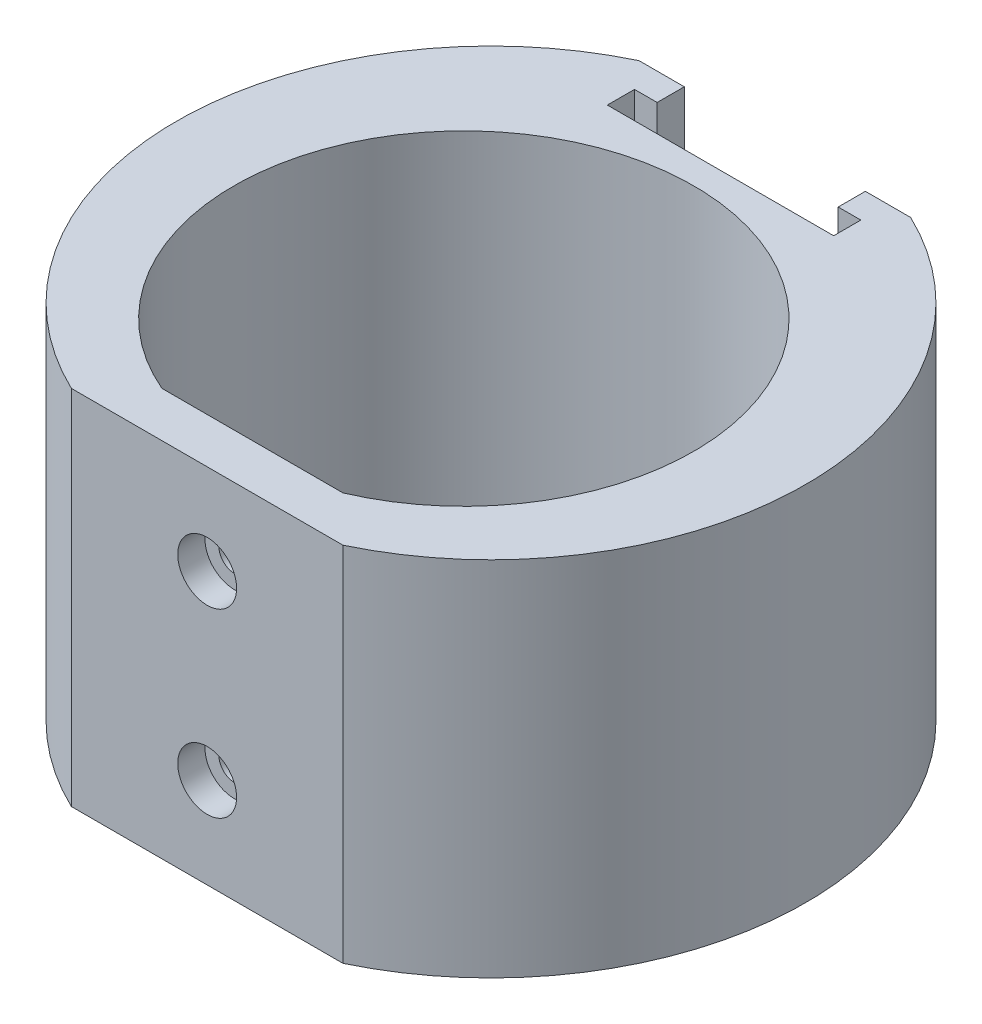
ISO-10303-21;
HEADER;
FILE_DESCRIPTION(('STEP AP214'),'2;1');
FILE_NAME('part.step','',(''),(''),'','','');
FILE_SCHEMA(('AUTOMOTIVE_DESIGN { 1 0 10303 214 1 1 1 1 }'));
ENDSEC;
DATA;
#1=APPLICATION_CONTEXT('core data for automotive mechanical design processes');
#2=APPLICATION_PROTOCOL_DEFINITION('international standard','automotive_design',2000,#1);
#3=PRODUCT_CONTEXT('',#1,'mechanical');
#4=PRODUCT('Part','Part','',(#3));
#5=PRODUCT_RELATED_PRODUCT_CATEGORY('part','',(#4));
#6=PRODUCT_DEFINITION_FORMATION('','',#4);
#7=PRODUCT_DEFINITION_CONTEXT('part definition',#1,'design');
#8=PRODUCT_DEFINITION('design','',#6,#7);
#9=PRODUCT_DEFINITION_SHAPE('','',#8);
#10=(LENGTH_UNIT() NAMED_UNIT(*) SI_UNIT(.MILLI.,.METRE.));
#11=(NAMED_UNIT(*) PLANE_ANGLE_UNIT() SI_UNIT($,.RADIAN.));
#12=(NAMED_UNIT(*) SI_UNIT($,.STERADIAN.) SOLID_ANGLE_UNIT());
#13=UNCERTAINTY_MEASURE_WITH_UNIT(LENGTH_MEASURE(1.E-05),#10,'distance_accuracy_value','');
#14=(GEOMETRIC_REPRESENTATION_CONTEXT(3) GLOBAL_UNCERTAINTY_ASSIGNED_CONTEXT((#13)) GLOBAL_UNIT_ASSIGNED_CONTEXT((#10,
#11,#12)) REPRESENTATION_CONTEXT('',''));
#15=CARTESIAN_POINT('',(0.,0.,0.));
#16=DIRECTION('',(0.,0.,1.));
#17=DIRECTION('',(1.,0.,0.));
#18=AXIS2_PLACEMENT_3D('',#15,#16,#17);
#19=CARTESIAN_POINT('',(0.,20.,-3.));
#20=DIRECTION('',(0.,1.,0.));
#21=DIRECTION('',(0.,0.,1.));
#22=AXIS2_PLACEMENT_3D('',#19,#20,#21);
#23=PLANE('',#22);
#24=DIRECTION('',(0.,0.,-1.));
#25=VECTOR('',#24,1.);
#26=CARTESIAN_POINT('',(10.,20.,-31.3486616318795));
#27=LINE('',#26,#25);
#28=CARTESIAN_POINT('',(10.,20.,-31.3486616318795));
#29=VERTEX_POINT('',#28);
#30=CARTESIAN_POINT('',(10.,20.,-34.3486616318795));
#31=VERTEX_POINT('',#30);
#32=EDGE_CURVE('E269',#29,#31,#27,.T.);
#33=ORIENTED_EDGE('',*,*,#32,.F.);
#34=DIRECTION('',(-1.,0.,0.));
#35=VECTOR('',#34,1.);
#36=CARTESIAN_POINT('',(12.5,20.,-31.3486616318795));
#37=LINE('',#36,#35);
#38=CARTESIAN_POINT('',(12.5,20.,-31.3486616318795));
#39=VERTEX_POINT('',#38);
#40=EDGE_CURVE('E274',#39,#29,#37,.T.);
#41=ORIENTED_EDGE('',*,*,#40,.F.);
#42=DIRECTION('',(0.,0.,-1.));
#43=VECTOR('',#42,1.);
#44=CARTESIAN_POINT('',(12.5,20.,-28.3486616318795));
#45=LINE('',#44,#43);
#46=CARTESIAN_POINT('',(12.5,20.,-28.3486616318795));
#47=VERTEX_POINT('',#46);
#48=EDGE_CURVE('E289',#47,#39,#45,.T.);
#49=ORIENTED_EDGE('',*,*,#48,.F.);
#50=DIRECTION('',(1.,0.,0.));
#51=VECTOR('',#50,1.);
#52=CARTESIAN_POINT('',(-12.5,20.,-28.3486616318795));
#53=LINE('',#52,#51);
#54=CARTESIAN_POINT('',(-12.5,20.,-28.3486616318795));
#55=VERTEX_POINT('',#54);
#56=EDGE_CURVE('E286',#55,#47,#53,.T.);
#57=ORIENTED_EDGE('',*,*,#56,.F.);
#58=DIRECTION('',(0.,0.,1.));
#59=VECTOR('',#58,1.);
#60=CARTESIAN_POINT('',(-12.5,20.,-31.3486616318795));
#61=LINE('',#60,#59);
#62=CARTESIAN_POINT('',(-12.5,20.,-31.3486616318795));
#63=VERTEX_POINT('',#62);
#64=EDGE_CURVE('E283',#63,#55,#61,.T.);
#65=ORIENTED_EDGE('',*,*,#64,.F.);
#66=DIRECTION('',(-1.,0.,0.));
#67=VECTOR('',#66,1.);
#68=CARTESIAN_POINT('',(-10.,20.,-31.3486616318795));
#69=LINE('',#68,#67);
#70=CARTESIAN_POINT('',(-10.,20.,-31.3486616318795));
#71=VERTEX_POINT('',#70);
#72=EDGE_CURVE('E185',#71,#63,#69,.T.);
#73=ORIENTED_EDGE('',*,*,#72,.F.);
#74=DIRECTION('',(0.,0.,1.));
#75=VECTOR('',#74,1.);
#76=CARTESIAN_POINT('',(-10.,20.,-34.3486616318795));
#77=LINE('',#76,#75);
#78=CARTESIAN_POINT('',(-10.,20.,-34.3486616318795));
#79=VERTEX_POINT('',#78);
#80=EDGE_CURVE('E168',#79,#71,#77,.T.);
#81=ORIENTED_EDGE('',*,*,#80,.F.);
#82=DIRECTION('',(-1.,0.,0.));
#83=VECTOR('',#82,1.);
#84=CARTESIAN_POINT('',(-15.,20.,-34.3486616318795));
#85=LINE('',#84,#83);
#86=CARTESIAN_POINT('',(-15.,20.,-34.3486616318795));
#87=VERTEX_POINT('',#86);
#88=EDGE_CURVE('E181',#79,#87,#85,.T.);
#89=ORIENTED_EDGE('',*,*,#88,.T.);
#90=CARTESIAN_POINT('',(0.,20.,-3.));
#91=DIRECTION('',(0.,1.,0.));
#92=DIRECTION('',(0.,0.,1.));
#93=AXIS2_PLACEMENT_3D('',#90,#91,#92);
#94=CIRCLE('',#93,34.7525335207388);
#95=CARTESIAN_POINT('',(-15.,20.,28.3486616318795));
#96=VERTEX_POINT('',#95);
#97=EDGE_CURVE('E197',#87,#96,#94,.T.);
#98=ORIENTED_EDGE('',*,*,#97,.T.);
#99=DIRECTION('',(1.,0.,0.));
#100=VECTOR('',#99,1.);
#101=CARTESIAN_POINT('',(-15.,20.,28.3486616318795));
#102=LINE('',#101,#100);
#103=CARTESIAN_POINT('',(15.,20.,28.3486616318795));
#104=VERTEX_POINT('',#103);
#105=EDGE_CURVE('E204',#96,#104,#102,.T.);
#106=ORIENTED_EDGE('',*,*,#105,.T.);
#107=CARTESIAN_POINT('',(0.,20.,-3.));
#108=DIRECTION('',(0.,1.,0.));
#109=DIRECTION('',(0.,0.,1.));
#110=AXIS2_PLACEMENT_3D('',#107,#108,#109);
#111=CIRCLE('',#110,34.7525335207388);
#112=CARTESIAN_POINT('',(15.,20.,-34.3486616318795));
#113=VERTEX_POINT('',#112);
#114=EDGE_CURVE('E194',#104,#113,#111,.T.);
#115=ORIENTED_EDGE('',*,*,#114,.T.);
#116=EDGE_CURVE('E193',#113,#31,#85,.T.);
#117=ORIENTED_EDGE('',*,*,#116,.T.);
#118=EDGE_LOOP('',(#33,#41,#49,#57,#65,#73,#81,#89,#98,#106,#115,#117));
#119=FACE_BOUND('',#118,.T.);
#120=DIRECTION('',(1.,0.,0.));
#121=VECTOR('',#120,1.);
#122=CARTESIAN_POINT('',(-10.,20.,23.3486616318795));
#123=LINE('',#122,#121);
#124=CARTESIAN_POINT('',(-10.,20.,23.3486616318795));
#125=VERTEX_POINT('',#124);
#126=CARTESIAN_POINT('',(10.,20.,23.3486616318795));
#127=VERTEX_POINT('',#126);
#128=EDGE_CURVE('E309',#125,#127,#123,.T.);
#129=ORIENTED_EDGE('',*,*,#128,.F.);
#130=CARTESIAN_POINT('',(0.,20.,0.));
#131=DIRECTION('',(0.,1.,0.));
#132=DIRECTION('',(0.,0.,1.));
#133=AXIS2_PLACEMENT_3D('',#130,#131,#132);
#134=CIRCLE('',#133,25.4);
#135=EDGE_CURVE('E306',#127,#125,#134,.T.);
#136=ORIENTED_EDGE('',*,*,#135,.F.);
#137=EDGE_LOOP('',(#129,#136));
#138=FACE_BOUND('',#137,.T.);
#139=ADVANCED_FACE('F39',(#119,#138),#23,.T.);
#140=CARTESIAN_POINT('',(0.,-20.,-3.));
#141=DIRECTION('',(0.,1.,0.));
#142=DIRECTION('',(0.,0.,1.));
#143=AXIS2_PLACEMENT_3D('',#140,#141,#142);
#144=PLANE('',#143);
#145=CARTESIAN_POINT('',(0.,-20.,-3.));
#146=DIRECTION('',(0.,1.,0.));
#147=DIRECTION('',(0.,0.,1.));
#148=AXIS2_PLACEMENT_3D('',#145,#146,#147);
#149=CIRCLE('',#148,34.7525335207388);
#150=CARTESIAN_POINT('',(15.,-20.,28.3486616318795));
#151=VERTEX_POINT('',#150);
#152=CARTESIAN_POINT('',(15.,-20.,-34.3486616318795));
#153=VERTEX_POINT('',#152);
#154=EDGE_CURVE('E207',#151,#153,#149,.T.);
#155=ORIENTED_EDGE('',*,*,#154,.F.);
#156=DIRECTION('',(1.,0.,0.));
#157=VECTOR('',#156,1.);
#158=CARTESIAN_POINT('',(-15.,-20.,28.3486616318795));
#159=LINE('',#158,#157);
#160=CARTESIAN_POINT('',(-15.,-20.,28.3486616318795));
#161=VERTEX_POINT('',#160);
#162=EDGE_CURVE('E199',#161,#151,#159,.T.);
#163=ORIENTED_EDGE('',*,*,#162,.F.);
#164=CARTESIAN_POINT('',(0.,-20.,-3.));
#165=DIRECTION('',(0.,1.,0.));
#166=DIRECTION('',(0.,0.,1.));
#167=AXIS2_PLACEMENT_3D('',#164,#165,#166);
#168=CIRCLE('',#167,34.7525335207388);
#169=CARTESIAN_POINT('',(-15.,-20.,-34.3486616318795));
#170=VERTEX_POINT('',#169);
#171=EDGE_CURVE('E213',#170,#161,#168,.T.);
#172=ORIENTED_EDGE('',*,*,#171,.F.);
#173=DIRECTION('',(-1.,0.,0.));
#174=VECTOR('',#173,1.);
#175=CARTESIAN_POINT('',(-15.,-20.,-34.3486616318795));
#176=LINE('',#175,#174);
#177=EDGE_CURVE('E210',#153,#170,#176,.T.);
#178=ORIENTED_EDGE('',*,*,#177,.F.);
#179=EDGE_LOOP('',(#155,#163,#172,#178));
#180=FACE_BOUND('',#179,.T.);
#181=CARTESIAN_POINT('',(0.,-20.,0.));
#182=DIRECTION('',(0.,1.,0.));
#183=DIRECTION('',(0.,0.,1.));
#184=AXIS2_PLACEMENT_3D('',#181,#182,#183);
#185=CIRCLE('',#184,25.4);
#186=CARTESIAN_POINT('',(10.,-20.,23.3486616318795));
#187=VERTEX_POINT('',#186);
#188=CARTESIAN_POINT('',(-10.,-20.,23.3486616318795));
#189=VERTEX_POINT('',#188);
#190=EDGE_CURVE('E296',#187,#189,#185,.T.);
#191=ORIENTED_EDGE('',*,*,#190,.T.);
#192=DIRECTION('',(1.,0.,0.));
#193=VECTOR('',#192,1.);
#194=CARTESIAN_POINT('',(-10.,-20.,23.3486616318795));
#195=LINE('',#194,#193);
#196=EDGE_CURVE('E310',#189,#187,#195,.T.);
#197=ORIENTED_EDGE('',*,*,#196,.T.);
#198=EDGE_LOOP('',(#191,#197));
#199=FACE_BOUND('',#198,.T.);
#200=ADVANCED_FACE('F326',(#180,#199),#144,.F.);
#201=CARTESIAN_POINT('',(0.,20.,-3.));
#202=DIRECTION('',(0.,-1.,0.));
#203=DIRECTION('',(0.,0.,-1.));
#204=AXIS2_PLACEMENT_3D('',#201,#202,#203);
#205=CYLINDRICAL_SURFACE('',#204,34.7525335207388);
#206=ORIENTED_EDGE('',*,*,#154,.T.);
#207=DIRECTION('',(0.,-1.,0.));
#208=VECTOR('',#207,1.);
#209=CARTESIAN_POINT('',(15.,20.,-34.3486616318795));
#210=LINE('',#209,#208);
#211=EDGE_CURVE('E222',#113,#153,#210,.T.);
#212=ORIENTED_EDGE('',*,*,#211,.F.);
#213=ORIENTED_EDGE('',*,*,#114,.F.);
#214=DIRECTION('',(0.,-1.,0.));
#215=VECTOR('',#214,1.);
#216=CARTESIAN_POINT('',(15.,20.,28.3486616318795));
#217=LINE('',#216,#215);
#218=EDGE_CURVE('E206',#104,#151,#217,.T.);
#219=ORIENTED_EDGE('',*,*,#218,.T.);
#220=EDGE_LOOP('',(#206,#212,#213,#219));
#221=FACE_BOUND('',#220,.T.);
#222=ADVANCED_FACE('F333',(#221),#205,.T.);
#223=CARTESIAN_POINT('',(-15.,20.,-34.3486616318795));
#224=DIRECTION('',(0.,0.,1.));
#225=DIRECTION('',(1.,0.,0.));
#226=AXIS2_PLACEMENT_3D('',#223,#224,#225);
#227=PLANE('',#226);
#228=DIRECTION('',(-1.,0.,0.));
#229=VECTOR('',#228,1.);
#230=CARTESIAN_POINT('',(-10.,-7.5,-34.3486616318795));
#231=LINE('',#230,#229);
#232=CARTESIAN_POINT('',(8.,-7.5,-34.3486616318795));
#233=VERTEX_POINT('',#232);
#234=CARTESIAN_POINT('',(-8.,-7.5,-34.3486616318795));
#235=VERTEX_POINT('',#234);
#236=EDGE_CURVE('E265',#233,#235,#231,.T.);
#237=ORIENTED_EDGE('',*,*,#236,.F.);
#238=CARTESIAN_POINT('',(8.,-5.5,-34.3486616318795));
#239=DIRECTION('',(0.,0.,1.));
#240=DIRECTION('',(1.,0.,0.));
#241=AXIS2_PLACEMENT_3D('',#238,#239,#240);
#242=CIRCLE('',#241,2.);
#243=CARTESIAN_POINT('',(10.,-5.5,-34.3486616318795));
#244=VERTEX_POINT('',#243);
#245=EDGE_CURVE('E250',#233,#244,#242,.T.);
#246=ORIENTED_EDGE('',*,*,#245,.T.);
#247=DIRECTION('',(0.,1.,0.));
#248=VECTOR('',#247,1.);
#249=CARTESIAN_POINT('',(10.,-7.5,-34.3486616318795));
#250=LINE('',#249,#248);
#251=EDGE_CURVE('E294',#244,#31,#250,.T.);
#252=ORIENTED_EDGE('',*,*,#251,.T.);
#253=ORIENTED_EDGE('',*,*,#116,.F.);
#254=ORIENTED_EDGE('',*,*,#211,.T.);
#255=ORIENTED_EDGE('',*,*,#177,.T.);
#256=DIRECTION('',(0.,-1.,0.));
#257=VECTOR('',#256,1.);
#258=CARTESIAN_POINT('',(-15.,20.,-34.3486616318795));
#259=LINE('',#258,#257);
#260=EDGE_CURVE('E191',#87,#170,#259,.T.);
#261=ORIENTED_EDGE('',*,*,#260,.F.);
#262=ORIENTED_EDGE('',*,*,#88,.F.);
#263=DIRECTION('',(0.,1.,0.));
#264=VECTOR('',#263,1.);
#265=CARTESIAN_POINT('',(-10.,-7.5,-34.3486616318795));
#266=LINE('',#265,#264);
#267=CARTESIAN_POINT('',(-10.,-5.5,-34.3486616318795));
#268=VERTEX_POINT('',#267);
#269=EDGE_CURVE('E164',#268,#79,#266,.T.);
#270=ORIENTED_EDGE('',*,*,#269,.F.);
#271=CARTESIAN_POINT('',(-8.,-5.5,-34.3486616318795));
#272=DIRECTION('',(0.,0.,1.));
#273=DIRECTION('',(1.,0.,0.));
#274=AXIS2_PLACEMENT_3D('',#271,#272,#273);
#275=CIRCLE('',#274,2.);
#276=EDGE_CURVE('E11',#268,#235,#275,.T.);
#277=ORIENTED_EDGE('',*,*,#276,.T.);
#278=EDGE_LOOP('',(#237,#246,#252,#253,#254,#255,#261,#262,#270,#277));
#279=FACE_BOUND('',#278,.T.);
#280=ADVANCED_FACE('F189',(#279),#227,.F.);
#281=CARTESIAN_POINT('',(0.,20.,-3.));
#282=DIRECTION('',(0.,-1.,0.));
#283=DIRECTION('',(0.,0.,-1.));
#284=AXIS2_PLACEMENT_3D('',#281,#282,#283);
#285=CYLINDRICAL_SURFACE('',#284,34.7525335207388);
#286=ORIENTED_EDGE('',*,*,#171,.T.);
#287=DIRECTION('',(0.,-1.,0.));
#288=VECTOR('',#287,1.);
#289=CARTESIAN_POINT('',(-15.,20.,28.3486616318795));
#290=LINE('',#289,#288);
#291=EDGE_CURVE('E218',#96,#161,#290,.T.);
#292=ORIENTED_EDGE('',*,*,#291,.F.);
#293=ORIENTED_EDGE('',*,*,#97,.F.);
#294=ORIENTED_EDGE('',*,*,#260,.T.);
#295=EDGE_LOOP('',(#286,#292,#293,#294));
#296=FACE_BOUND('',#295,.T.);
#297=ADVANCED_FACE('F342',(#296),#285,.T.);
#298=CARTESIAN_POINT('',(-15.,20.,28.3486616318795));
#299=DIRECTION('',(0.,0.,-1.));
#300=DIRECTION('',(-1.,0.,0.));
#301=AXIS2_PLACEMENT_3D('',#298,#299,#300);
#302=PLANE('',#301);
#303=CARTESIAN_POINT('',(0.,10.,28.3486616318795));
#304=DIRECTION('',(0.,0.,1.));
#305=DIRECTION('',(1.,0.,0.));
#306=AXIS2_PLACEMENT_3D('',#303,#304,#305);
#307=CIRCLE('',#306,3.25);
#308=CARTESIAN_POINT('',(3.25,10.,28.3486616318795));
#309=VERTEX_POINT('',#308);
#310=EDGE_CURVE('E439',#309,#309,#307,.T.);
#311=ORIENTED_EDGE('',*,*,#310,.F.);
#312=EDGE_LOOP('',(#311));
#313=FACE_BOUND('',#312,.T.);
#314=CARTESIAN_POINT('',(0.,-10.,28.3486616318795));
#315=DIRECTION('',(0.,0.,1.));
#316=DIRECTION('',(1.,0.,0.));
#317=AXIS2_PLACEMENT_3D('',#314,#315,#316);
#318=CIRCLE('',#317,3.25);
#319=CARTESIAN_POINT('',(3.25,-10.,28.3486616318795));
#320=VERTEX_POINT('',#319);
#321=EDGE_CURVE('E427',#320,#320,#318,.T.);
#322=ORIENTED_EDGE('',*,*,#321,.F.);
#323=EDGE_LOOP('',(#322));
#324=FACE_BOUND('',#323,.T.);
#325=ORIENTED_EDGE('',*,*,#162,.T.);
#326=ORIENTED_EDGE('',*,*,#218,.F.);
#327=ORIENTED_EDGE('',*,*,#105,.F.);
#328=ORIENTED_EDGE('',*,*,#291,.T.);
#329=EDGE_LOOP('',(#325,#326,#327,#328));
#330=FACE_BOUND('',#329,.T.);
#331=ADVANCED_FACE('F339',(#313,#324,#330),#302,.F.);
#332=CARTESIAN_POINT('',(0.,20.,0.));
#333=DIRECTION('',(0.,-1.,0.));
#334=DIRECTION('',(0.,0.,-1.));
#335=AXIS2_PLACEMENT_3D('',#332,#333,#334);
#336=CYLINDRICAL_SURFACE('',#335,25.4);
#337=ORIENTED_EDGE('',*,*,#190,.F.);
#338=DIRECTION('',(0.,-1.,0.));
#339=VECTOR('',#338,1.);
#340=CARTESIAN_POINT('',(10.,20.,23.3486616318795));
#341=LINE('',#340,#339);
#342=EDGE_CURVE('E312',#127,#187,#341,.T.);
#343=ORIENTED_EDGE('',*,*,#342,.F.);
#344=ORIENTED_EDGE('',*,*,#135,.T.);
#345=DIRECTION('',(0.,-1.,0.));
#346=VECTOR('',#345,1.);
#347=CARTESIAN_POINT('',(-10.,20.,23.3486616318795));
#348=LINE('',#347,#346);
#349=EDGE_CURVE('E211',#125,#189,#348,.T.);
#350=ORIENTED_EDGE('',*,*,#349,.T.);
#351=EDGE_LOOP('',(#337,#343,#344,#350));
#352=FACE_BOUND('',#351,.T.);
#353=ADVANCED_FACE('F320',(#352),#336,.F.);
#354=CARTESIAN_POINT('',(-10.,20.,23.3486616318795));
#355=DIRECTION('',(0.,0.,-1.));
#356=DIRECTION('',(-1.,0.,0.));
#357=AXIS2_PLACEMENT_3D('',#354,#355,#356);
#358=PLANE('',#357);
#359=CARTESIAN_POINT('',(0.,10.,23.3486616318795));
#360=DIRECTION('',(0.,0.,-1.));
#361=DIRECTION('',(-1.,0.,0.));
#362=AXIS2_PLACEMENT_3D('',#359,#360,#361);
#363=CIRCLE('',#362,1.7);
#364=CARTESIAN_POINT('',(-1.7,10.,23.3486616318795));
#365=VERTEX_POINT('',#364);
#366=EDGE_CURVE('E417',#365,#365,#363,.T.);
#367=ORIENTED_EDGE('',*,*,#366,.F.);
#368=EDGE_LOOP('',(#367));
#369=FACE_BOUND('',#368,.T.);
#370=CARTESIAN_POINT('',(0.,-10.,23.3486616318795));
#371=DIRECTION('',(0.,0.,-1.));
#372=DIRECTION('',(-1.,0.,0.));
#373=AXIS2_PLACEMENT_3D('',#370,#371,#372);
#374=CIRCLE('',#373,1.7);
#375=CARTESIAN_POINT('',(-1.69999999999999,-10.,23.3486616318795));
#376=VERTEX_POINT('',#375);
#377=EDGE_CURVE('E186',#376,#376,#374,.T.);
#378=ORIENTED_EDGE('',*,*,#377,.F.);
#379=EDGE_LOOP('',(#378));
#380=FACE_BOUND('',#379,.T.);
#381=ORIENTED_EDGE('',*,*,#196,.F.);
#382=ORIENTED_EDGE('',*,*,#349,.F.);
#383=ORIENTED_EDGE('',*,*,#128,.T.);
#384=ORIENTED_EDGE('',*,*,#342,.T.);
#385=EDGE_LOOP('',(#381,#382,#383,#384));
#386=FACE_BOUND('',#385,.T.);
#387=ADVANCED_FACE('F327',(#369,#380,#386),#358,.T.);
#388=CARTESIAN_POINT('',(10.,-7.5,-31.3486616318795));
#389=DIRECTION('',(1.,0.,0.));
#390=DIRECTION('',(0.,0.,-1.));
#391=AXIS2_PLACEMENT_3D('',#388,#389,#390);
#392=PLANE('',#391);
#393=ORIENTED_EDGE('',*,*,#251,.F.);
#394=DIRECTION('',(0.,0.,-1.));
#395=VECTOR('',#394,1.);
#396=CARTESIAN_POINT('',(10.,-5.5,-31.3486616318795));
#397=LINE('',#396,#395);
#398=CARTESIAN_POINT('',(10.,-5.5,-31.3486616318795));
#399=VERTEX_POINT('',#398);
#400=EDGE_CURVE('E237',#244,#399,#397,.F.);
#401=ORIENTED_EDGE('',*,*,#400,.T.);
#402=DIRECTION('',(0.,1.,0.));
#403=VECTOR('',#402,1.);
#404=CARTESIAN_POINT('',(10.,-7.5,-31.3486616318795));
#405=LINE('',#404,#403);
#406=EDGE_CURVE('E297',#399,#29,#405,.T.);
#407=ORIENTED_EDGE('',*,*,#406,.T.);
#408=ORIENTED_EDGE('',*,*,#32,.T.);
#409=EDGE_LOOP('',(#393,#401,#407,#408));
#410=FACE_BOUND('',#409,.T.);
#411=ADVANCED_FACE('F380',(#410),#392,.F.);
#412=CARTESIAN_POINT('',(12.5,-7.5,-31.3486616318795));
#413=DIRECTION('',(0.,0.,-1.));
#414=DIRECTION('',(-1.,0.,0.));
#415=AXIS2_PLACEMENT_3D('',#412,#413,#414);
#416=PLANE('',#415);
#417=DIRECTION('',(-1.,0.,0.));
#418=VECTOR('',#417,1.);
#419=CARTESIAN_POINT('',(12.5,-7.5,-31.3486616318795));
#420=LINE('',#419,#418);
#421=CARTESIAN_POINT('',(10.5,-7.5,-31.3486616318795));
#422=VERTEX_POINT('',#421);
#423=CARTESIAN_POINT('',(8.,-7.5,-31.3486616318795));
#424=VERTEX_POINT('',#423);
#425=EDGE_CURVE('E176',#422,#424,#420,.T.);
#426=ORIENTED_EDGE('',*,*,#425,.F.);
#427=CARTESIAN_POINT('',(10.5,-5.5,-31.3486616318795));
#428=DIRECTION('',(0.,0.,-1.));
#429=DIRECTION('',(-1.,0.,0.));
#430=AXIS2_PLACEMENT_3D('',#427,#428,#429);
#431=CIRCLE('',#430,2.);
#432=CARTESIAN_POINT('',(12.5,-5.5,-31.3486616318795));
#433=VERTEX_POINT('',#432);
#434=EDGE_CURVE('E54',#422,#433,#431,.F.);
#435=ORIENTED_EDGE('',*,*,#434,.T.);
#436=DIRECTION('',(0.,1.,0.));
#437=VECTOR('',#436,1.);
#438=CARTESIAN_POINT('',(12.5,-7.5,-31.3486616318795));
#439=LINE('',#438,#437);
#440=EDGE_CURVE('E299',#433,#39,#439,.T.);
#441=ORIENTED_EDGE('',*,*,#440,.T.);
#442=ORIENTED_EDGE('',*,*,#40,.T.);
#443=ORIENTED_EDGE('',*,*,#406,.F.);
#444=CARTESIAN_POINT('',(8.,-5.5,-31.3486616318795));
#445=DIRECTION('',(0.,0.,-1.));
#446=DIRECTION('',(-1.,0.,0.));
#447=AXIS2_PLACEMENT_3D('',#444,#445,#446);
#448=CIRCLE('',#447,2.);
#449=EDGE_CURVE('E252',#399,#424,#448,.T.);
#450=ORIENTED_EDGE('',*,*,#449,.T.);
#451=EDGE_LOOP('',(#426,#435,#441,#442,#443,#450));
#452=FACE_BOUND('',#451,.T.);
#453=ADVANCED_FACE('F374',(#452),#416,.F.);
#454=CARTESIAN_POINT('',(12.5,-7.5,-28.3486616318795));
#455=DIRECTION('',(1.,0.,0.));
#456=DIRECTION('',(0.,0.,-1.));
#457=AXIS2_PLACEMENT_3D('',#454,#455,#456);
#458=PLANE('',#457);
#459=ORIENTED_EDGE('',*,*,#440,.F.);
#460=DIRECTION('',(0.,0.,-1.));
#461=VECTOR('',#460,1.);
#462=CARTESIAN_POINT('',(12.5,-5.5,-28.3486616318795));
#463=LINE('',#462,#461);
#464=CARTESIAN_POINT('',(12.5,-5.5,-28.3486616318795));
#465=VERTEX_POINT('',#464);
#466=EDGE_CURVE('E248',#433,#465,#463,.F.);
#467=ORIENTED_EDGE('',*,*,#466,.T.);
#468=DIRECTION('',(0.,1.,0.));
#469=VECTOR('',#468,1.);
#470=CARTESIAN_POINT('',(12.5,-7.5,-28.3486616318795));
#471=LINE('',#470,#469);
#472=EDGE_CURVE('E301',#465,#47,#471,.T.);
#473=ORIENTED_EDGE('',*,*,#472,.T.);
#474=ORIENTED_EDGE('',*,*,#48,.T.);
#475=EDGE_LOOP('',(#459,#467,#473,#474));
#476=FACE_BOUND('',#475,.T.);
#477=ADVANCED_FACE('F394',(#476),#458,.F.);
#478=CARTESIAN_POINT('',(-12.5,-7.5,-28.3486616318795));
#479=DIRECTION('',(0.,0.,1.));
#480=DIRECTION('',(1.,0.,0.));
#481=AXIS2_PLACEMENT_3D('',#478,#479,#480);
#482=PLANE('',#481);
#483=DIRECTION('',(1.,0.,0.));
#484=VECTOR('',#483,1.);
#485=CARTESIAN_POINT('',(-12.5,-7.5,-28.3486616318795));
#486=LINE('',#485,#484);
#487=CARTESIAN_POINT('',(-10.5,-7.5,-28.3486616318795));
#488=VERTEX_POINT('',#487);
#489=CARTESIAN_POINT('',(10.5,-7.5,-28.3486616318795));
#490=VERTEX_POINT('',#489);
#491=EDGE_CURVE('E271',#488,#490,#486,.T.);
#492=ORIENTED_EDGE('',*,*,#491,.F.);
#493=CARTESIAN_POINT('',(-10.5,-5.5,-28.3486616318795));
#494=DIRECTION('',(0.,0.,1.));
#495=DIRECTION('',(1.,0.,0.));
#496=AXIS2_PLACEMENT_3D('',#493,#494,#495);
#497=CIRCLE('',#496,2.);
#498=CARTESIAN_POINT('',(-12.5,-5.5,-28.3486616318795));
#499=VERTEX_POINT('',#498);
#500=EDGE_CURVE('E242',#488,#499,#497,.F.);
#501=ORIENTED_EDGE('',*,*,#500,.T.);
#502=DIRECTION('',(0.,1.,0.));
#503=VECTOR('',#502,1.);
#504=CARTESIAN_POINT('',(-12.5,-7.5,-28.3486616318795));
#505=LINE('',#504,#503);
#506=EDGE_CURVE('E303',#499,#55,#505,.T.);
#507=ORIENTED_EDGE('',*,*,#506,.T.);
#508=ORIENTED_EDGE('',*,*,#56,.T.);
#509=ORIENTED_EDGE('',*,*,#472,.F.);
#510=CARTESIAN_POINT('',(10.5,-5.5,-28.3486616318795));
#511=DIRECTION('',(0.,0.,1.));
#512=DIRECTION('',(1.,0.,0.));
#513=AXIS2_PLACEMENT_3D('',#510,#511,#512);
#514=CIRCLE('',#513,2.);
#515=EDGE_CURVE('E240',#465,#490,#514,.F.);
#516=ORIENTED_EDGE('',*,*,#515,.T.);
#517=EDGE_LOOP('',(#492,#501,#507,#508,#509,#516));
#518=FACE_BOUND('',#517,.T.);
#519=ADVANCED_FACE('F370',(#518),#482,.F.);
#520=CARTESIAN_POINT('',(-12.5,-7.5,-31.3486616318795));
#521=DIRECTION('',(-1.,0.,0.));
#522=DIRECTION('',(0.,0.,1.));
#523=AXIS2_PLACEMENT_3D('',#520,#521,#522);
#524=PLANE('',#523);
#525=ORIENTED_EDGE('',*,*,#506,.F.);
#526=DIRECTION('',(0.,0.,1.));
#527=VECTOR('',#526,1.);
#528=CARTESIAN_POINT('',(-12.5,-5.5,-31.3486616318795));
#529=LINE('',#528,#527);
#530=CARTESIAN_POINT('',(-12.5,-5.5,-31.3486616318795));
#531=VERTEX_POINT('',#530);
#532=EDGE_CURVE('E62',#499,#531,#529,.F.);
#533=ORIENTED_EDGE('',*,*,#532,.T.);
#534=DIRECTION('',(0.,1.,0.));
#535=VECTOR('',#534,1.);
#536=CARTESIAN_POINT('',(-12.5,-7.5,-31.3486616318795));
#537=LINE('',#536,#535);
#538=EDGE_CURVE('E261',#531,#63,#537,.T.);
#539=ORIENTED_EDGE('',*,*,#538,.T.);
#540=ORIENTED_EDGE('',*,*,#64,.T.);
#541=EDGE_LOOP('',(#525,#533,#539,#540));
#542=FACE_BOUND('',#541,.T.);
#543=ADVANCED_FACE('F395',(#542),#524,.F.);
#544=CARTESIAN_POINT('',(-10.,-7.5,-31.3486616318795));
#545=DIRECTION('',(0.,0.,-1.));
#546=DIRECTION('',(-1.,0.,0.));
#547=AXIS2_PLACEMENT_3D('',#544,#545,#546);
#548=PLANE('',#547);
#549=ORIENTED_EDGE('',*,*,#538,.F.);
#550=CARTESIAN_POINT('',(-10.5,-5.5,-31.3486616318795));
#551=DIRECTION('',(0.,0.,-1.));
#552=DIRECTION('',(-1.,0.,0.));
#553=AXIS2_PLACEMENT_3D('',#550,#551,#552);
#554=CIRCLE('',#553,2.);
#555=CARTESIAN_POINT('',(-10.5,-7.5,-31.3486616318795));
#556=VERTEX_POINT('',#555);
#557=EDGE_CURVE('E245',#531,#556,#554,.F.);
#558=ORIENTED_EDGE('',*,*,#557,.T.);
#559=DIRECTION('',(-1.,0.,0.));
#560=VECTOR('',#559,1.);
#561=CARTESIAN_POINT('',(-10.,-7.5,-31.3486616318795));
#562=LINE('',#561,#560);
#563=CARTESIAN_POINT('',(-8.,-7.5,-31.3486616318795));
#564=VERTEX_POINT('',#563);
#565=EDGE_CURVE('E258',#564,#556,#562,.T.);
#566=ORIENTED_EDGE('',*,*,#565,.F.);
#567=CARTESIAN_POINT('',(-8.,-5.5,-31.3486616318795));
#568=DIRECTION('',(0.,0.,-1.));
#569=DIRECTION('',(-1.,0.,0.));
#570=AXIS2_PLACEMENT_3D('',#567,#568,#569);
#571=CIRCLE('',#570,2.);
#572=CARTESIAN_POINT('',(-10.,-5.5,-31.3486616318795));
#573=VERTEX_POINT('',#572);
#574=EDGE_CURVE('E47',#564,#573,#571,.T.);
#575=ORIENTED_EDGE('',*,*,#574,.T.);
#576=DIRECTION('',(0.,1.,0.));
#577=VECTOR('',#576,1.);
#578=CARTESIAN_POINT('',(-10.,-7.5,-31.3486616318795));
#579=LINE('',#578,#577);
#580=EDGE_CURVE('E175',#573,#71,#579,.T.);
#581=ORIENTED_EDGE('',*,*,#580,.T.);
#582=ORIENTED_EDGE('',*,*,#72,.T.);
#583=EDGE_LOOP('',(#549,#558,#566,#575,#581,#582));
#584=FACE_BOUND('',#583,.T.);
#585=ADVANCED_FACE('F256',(#584),#548,.F.);
#586=CARTESIAN_POINT('',(-10.,-7.5,-34.3486616318795));
#587=DIRECTION('',(-1.,0.,0.));
#588=DIRECTION('',(0.,0.,1.));
#589=AXIS2_PLACEMENT_3D('',#586,#587,#588);
#590=PLANE('',#589);
#591=ORIENTED_EDGE('',*,*,#580,.F.);
#592=DIRECTION('',(0.,0.,1.));
#593=VECTOR('',#592,1.);
#594=CARTESIAN_POINT('',(-10.,-5.5,-34.3486616318795));
#595=LINE('',#594,#593);
#596=EDGE_CURVE('E171',#573,#268,#595,.F.);
#597=ORIENTED_EDGE('',*,*,#596,.T.);
#598=ORIENTED_EDGE('',*,*,#269,.T.);
#599=ORIENTED_EDGE('',*,*,#80,.T.);
#600=EDGE_LOOP('',(#591,#597,#598,#599));
#601=FACE_BOUND('',#600,.T.);
#602=ADVANCED_FACE('F167',(#601),#590,.F.);
#603=CARTESIAN_POINT('',(0.,-7.5,0.));
#604=DIRECTION('',(0.,1.,0.));
#605=DIRECTION('',(0.,0.,1.));
#606=AXIS2_PLACEMENT_3D('',#603,#604,#605);
#607=PLANE('',#606);
#608=ORIENTED_EDGE('',*,*,#425,.T.);
#609=DIRECTION('',(0.,0.,-1.));
#610=VECTOR('',#609,1.);
#611=CARTESIAN_POINT('',(8.,-7.5,0.));
#612=LINE('',#611,#610);
#613=EDGE_CURVE('E234',#424,#233,#612,.T.);
#614=ORIENTED_EDGE('',*,*,#613,.T.);
#615=ORIENTED_EDGE('',*,*,#236,.T.);
#616=DIRECTION('',(0.,0.,1.));
#617=VECTOR('',#616,1.);
#618=CARTESIAN_POINT('',(-8.,-7.5,0.));
#619=LINE('',#618,#617);
#620=EDGE_CURVE('E231',#235,#564,#619,.T.);
#621=ORIENTED_EDGE('',*,*,#620,.T.);
#622=ORIENTED_EDGE('',*,*,#565,.T.);
#623=DIRECTION('',(0.,0.,1.));
#624=VECTOR('',#623,1.);
#625=CARTESIAN_POINT('',(-10.5,-7.5,0.));
#626=LINE('',#625,#624);
#627=EDGE_CURVE('E228',#556,#488,#626,.T.);
#628=ORIENTED_EDGE('',*,*,#627,.T.);
#629=ORIENTED_EDGE('',*,*,#491,.T.);
#630=DIRECTION('',(0.,0.,-1.));
#631=VECTOR('',#630,1.);
#632=CARTESIAN_POINT('',(10.5,-7.5,0.));
#633=LINE('',#632,#631);
#634=EDGE_CURVE('E225',#490,#422,#633,.T.);
#635=ORIENTED_EDGE('',*,*,#634,.T.);
#636=EDGE_LOOP('',(#608,#614,#615,#621,#622,#628,#629,#635));
#637=FACE_BOUND('',#636,.T.);
#638=ADVANCED_FACE('F267',(#637),#607,.T.);
#639=CARTESIAN_POINT('',(0.,-10.,28.3486616318795));
#640=DIRECTION('',(0.,0.,1.));
#641=DIRECTION('',(1.,0.,0.));
#642=AXIS2_PLACEMENT_3D('',#639,#640,#641);
#643=CYLINDRICAL_SURFACE('',#642,1.7);
#644=CARTESIAN_POINT('',(0.,-10.,25.3486616318795));
#645=DIRECTION('',(0.,0.,1.));
#646=DIRECTION('',(1.,0.,0.));
#647=AXIS2_PLACEMENT_3D('',#644,#645,#646);
#648=CIRCLE('',#647,1.7);
#649=CARTESIAN_POINT('',(1.70000000000001,-10.,25.3486616318795));
#650=VERTEX_POINT('',#649);
#651=EDGE_CURVE('E421',#650,#650,#648,.T.);
#652=ORIENTED_EDGE('',*,*,#651,.T.);
#653=EDGE_LOOP('',(#652));
#654=FACE_BOUND('',#653,.T.);
#655=ORIENTED_EDGE('',*,*,#377,.T.);
#656=EDGE_LOOP('',(#655));
#657=FACE_BOUND('',#656,.T.);
#658=ADVANCED_FACE('F459',(#654,#657),#643,.F.);
#659=CARTESIAN_POINT('',(1.70000000000001,-10.,25.3486616318795));
#660=DIRECTION('',(0.,0.,-1.));
#661=DIRECTION('',(-1.,0.,0.));
#662=AXIS2_PLACEMENT_3D('',#659,#660,#661);
#663=PLANE('',#662);
#664=ORIENTED_EDGE('',*,*,#651,.F.);
#665=EDGE_LOOP('',(#664));
#666=FACE_BOUND('',#665,.T.);
#667=CARTESIAN_POINT('',(0.,-10.,25.3486616318795));
#668=DIRECTION('',(0.,0.,1.));
#669=DIRECTION('',(1.,0.,0.));
#670=AXIS2_PLACEMENT_3D('',#667,#668,#669);
#671=CIRCLE('',#670,3.25);
#672=CARTESIAN_POINT('',(3.25,-10.,25.3486616318795));
#673=VERTEX_POINT('',#672);
#674=EDGE_CURVE('E423',#673,#673,#671,.T.);
#675=ORIENTED_EDGE('',*,*,#674,.T.);
#676=EDGE_LOOP('',(#675));
#677=FACE_BOUND('',#676,.T.);
#678=ADVANCED_FACE('F449',(#666,#677),#663,.F.);
#679=CARTESIAN_POINT('',(0.,-10.,28.3486616318795));
#680=DIRECTION('',(0.,0.,1.));
#681=DIRECTION('',(1.,0.,0.));
#682=AXIS2_PLACEMENT_3D('',#679,#680,#681);
#683=CYLINDRICAL_SURFACE('',#682,3.25);
#684=ORIENTED_EDGE('',*,*,#674,.F.);
#685=EDGE_LOOP('',(#684));
#686=FACE_BOUND('',#685,.T.);
#687=ORIENTED_EDGE('',*,*,#321,.T.);
#688=EDGE_LOOP('',(#687));
#689=FACE_BOUND('',#688,.T.);
#690=ADVANCED_FACE('F446',(#686,#689),#683,.F.);
#691=CARTESIAN_POINT('',(0.,10.,28.3486616318795));
#692=DIRECTION('',(0.,0.,1.));
#693=DIRECTION('',(1.,0.,0.));
#694=AXIS2_PLACEMENT_3D('',#691,#692,#693);
#695=CYLINDRICAL_SURFACE('',#694,1.7);
#696=CARTESIAN_POINT('',(0.,10.,25.3486616318795));
#697=DIRECTION('',(0.,0.,1.));
#698=DIRECTION('',(1.,0.,0.));
#699=AXIS2_PLACEMENT_3D('',#696,#697,#698);
#700=CIRCLE('',#699,1.7);
#701=CARTESIAN_POINT('',(1.7,10.,25.3486616318795));
#702=VERTEX_POINT('',#701);
#703=EDGE_CURVE('E433',#702,#702,#700,.T.);
#704=ORIENTED_EDGE('',*,*,#703,.T.);
#705=EDGE_LOOP('',(#704));
#706=FACE_BOUND('',#705,.T.);
#707=ORIENTED_EDGE('',*,*,#366,.T.);
#708=EDGE_LOOP('',(#707));
#709=FACE_BOUND('',#708,.T.);
#710=ADVANCED_FACE('F448',(#706,#709),#695,.F.);
#711=CARTESIAN_POINT('',(1.7,10.,25.3486616318795));
#712=DIRECTION('',(0.,0.,-1.));
#713=DIRECTION('',(-1.,0.,0.));
#714=AXIS2_PLACEMENT_3D('',#711,#712,#713);
#715=PLANE('',#714);
#716=ORIENTED_EDGE('',*,*,#703,.F.);
#717=EDGE_LOOP('',(#716));
#718=FACE_BOUND('',#717,.T.);
#719=CARTESIAN_POINT('',(0.,10.,25.3486616318795));
#720=DIRECTION('',(0.,0.,1.));
#721=DIRECTION('',(1.,0.,0.));
#722=AXIS2_PLACEMENT_3D('',#719,#720,#721);
#723=CIRCLE('',#722,3.25);
#724=CARTESIAN_POINT('',(3.25,10.,25.3486616318795));
#725=VERTEX_POINT('',#724);
#726=EDGE_CURVE('E436',#725,#725,#723,.T.);
#727=ORIENTED_EDGE('',*,*,#726,.T.);
#728=EDGE_LOOP('',(#727));
#729=FACE_BOUND('',#728,.T.);
#730=ADVANCED_FACE('F456',(#718,#729),#715,.F.);
#731=CARTESIAN_POINT('',(0.,10.,28.3486616318795));
#732=DIRECTION('',(0.,0.,1.));
#733=DIRECTION('',(1.,0.,0.));
#734=AXIS2_PLACEMENT_3D('',#731,#732,#733);
#735=CYLINDRICAL_SURFACE('',#734,3.25);
#736=ORIENTED_EDGE('',*,*,#726,.F.);
#737=EDGE_LOOP('',(#736));
#738=FACE_BOUND('',#737,.T.);
#739=ORIENTED_EDGE('',*,*,#310,.T.);
#740=EDGE_LOOP('',(#739));
#741=FACE_BOUND('',#740,.T.);
#742=ADVANCED_FACE('F355',(#738,#741),#735,.F.);
#743=CARTESIAN_POINT('',(8.,-5.5,0.));
#744=DIRECTION('',(0.,0.,-1.));
#745=DIRECTION('',(-1.,0.,0.));
#746=AXIS2_PLACEMENT_3D('',#743,#744,#745);
#747=CYLINDRICAL_SURFACE('',#746,2.);
#748=ORIENTED_EDGE('',*,*,#449,.F.);
#749=ORIENTED_EDGE('',*,*,#400,.F.);
#750=ORIENTED_EDGE('',*,*,#245,.F.);
#751=ORIENTED_EDGE('',*,*,#613,.F.);
#752=EDGE_LOOP('',(#748,#749,#750,#751));
#753=FACE_BOUND('',#752,.T.);
#754=ADVANCED_FACE('F352',(#753),#747,.F.);
#755=CARTESIAN_POINT('',(-8.,-5.5,0.));
#756=DIRECTION('',(0.,0.,1.));
#757=DIRECTION('',(1.,0.,0.));
#758=AXIS2_PLACEMENT_3D('',#755,#756,#757);
#759=CYLINDRICAL_SURFACE('',#758,2.);
#760=ORIENTED_EDGE('',*,*,#276,.F.);
#761=ORIENTED_EDGE('',*,*,#596,.F.);
#762=ORIENTED_EDGE('',*,*,#574,.F.);
#763=ORIENTED_EDGE('',*,*,#620,.F.);
#764=EDGE_LOOP('',(#760,#761,#762,#763));
#765=FACE_BOUND('',#764,.T.);
#766=ADVANCED_FACE('F263',(#765),#759,.F.);
#767=CARTESIAN_POINT('',(-10.5,-5.5,0.));
#768=DIRECTION('',(0.,0.,1.));
#769=DIRECTION('',(1.,0.,0.));
#770=AXIS2_PLACEMENT_3D('',#767,#768,#769);
#771=CYLINDRICAL_SURFACE('',#770,2.);
#772=ORIENTED_EDGE('',*,*,#557,.F.);
#773=ORIENTED_EDGE('',*,*,#532,.F.);
#774=ORIENTED_EDGE('',*,*,#500,.F.);
#775=ORIENTED_EDGE('',*,*,#627,.F.);
#776=EDGE_LOOP('',(#772,#773,#774,#775));
#777=FACE_BOUND('',#776,.T.);
#778=ADVANCED_FACE('F358',(#777),#771,.F.);
#779=CARTESIAN_POINT('',(10.5,-5.5,0.));
#780=DIRECTION('',(0.,0.,-1.));
#781=DIRECTION('',(-1.,0.,0.));
#782=AXIS2_PLACEMENT_3D('',#779,#780,#781);
#783=CYLINDRICAL_SURFACE('',#782,2.);
#784=ORIENTED_EDGE('',*,*,#515,.F.);
#785=ORIENTED_EDGE('',*,*,#466,.F.);
#786=ORIENTED_EDGE('',*,*,#434,.F.);
#787=ORIENTED_EDGE('',*,*,#634,.F.);
#788=EDGE_LOOP('',(#784,#785,#786,#787));
#789=FACE_BOUND('',#788,.T.);
#790=ADVANCED_FACE('F41',(#789),#783,.F.);
#791=CLOSED_SHELL('',(#139,#200,#222,#280,#297,#331,#353,#387,#411,#453,#477,#519,#543,#585,
#602,#638,#658,#678,#690,#710,#730,#742,#754,#766,#778,#790));
#792=MANIFOLD_SOLID_BREP('B2',#791);
#793=ADVANCED_BREP_SHAPE_REPRESENTATION('',(#18,#792),#14);
#794=SHAPE_DEFINITION_REPRESENTATION(#9,#793);
ENDSEC;
END-ISO-10303-21;
